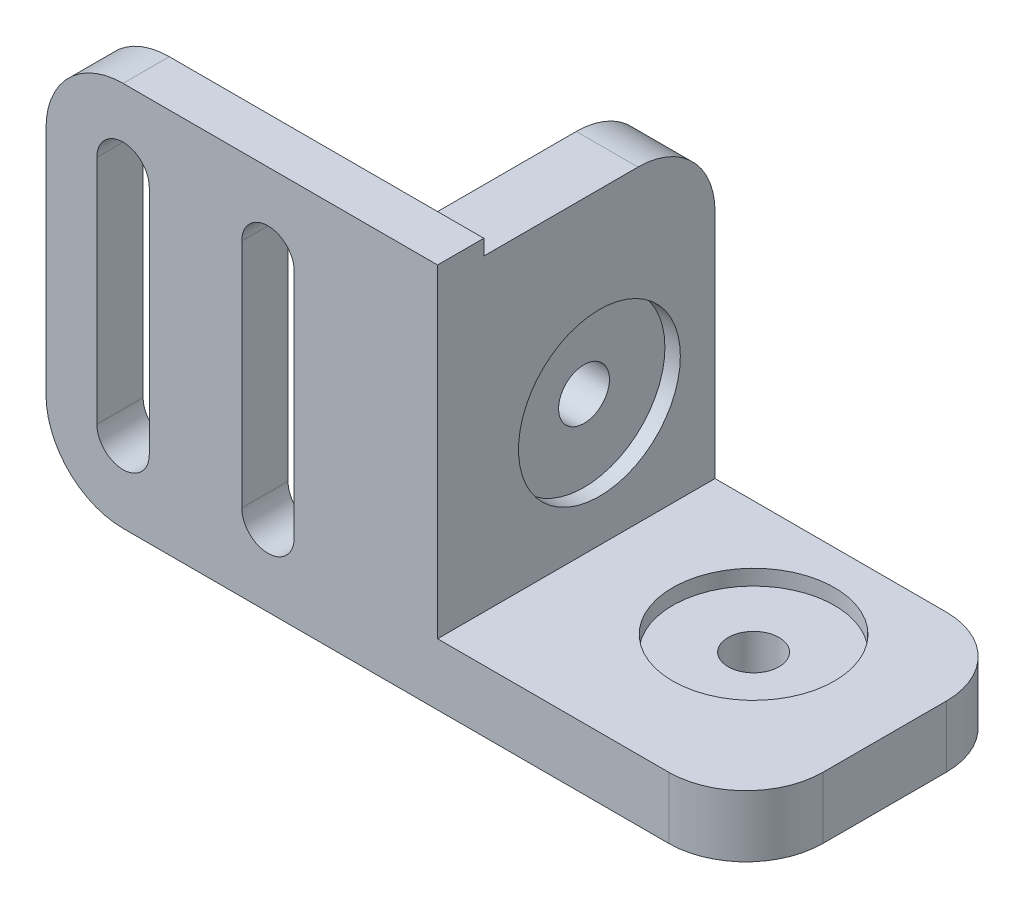
ISO-10303-21;
HEADER;
FILE_DESCRIPTION(('STEP AP214'),'2;1');
FILE_NAME('part.step','',(''),(''),'','','');
FILE_SCHEMA(('AUTOMOTIVE_DESIGN { 1 0 10303 214 1 1 1 1 }'));
ENDSEC;
DATA;
#1=APPLICATION_CONTEXT('core data for automotive mechanical design processes');
#2=APPLICATION_PROTOCOL_DEFINITION('international standard','automotive_design',2000,#1);
#3=PRODUCT_CONTEXT('',#1,'mechanical');
#4=PRODUCT('Part','Part','',(#3));
#5=PRODUCT_RELATED_PRODUCT_CATEGORY('part','',(#4));
#6=PRODUCT_DEFINITION_FORMATION('','',#4);
#7=PRODUCT_DEFINITION_CONTEXT('part definition',#1,'design');
#8=PRODUCT_DEFINITION('design','',#6,#7);
#9=PRODUCT_DEFINITION_SHAPE('','',#8);
#10=(LENGTH_UNIT() NAMED_UNIT(*) SI_UNIT(.MILLI.,.METRE.));
#11=(NAMED_UNIT(*) PLANE_ANGLE_UNIT() SI_UNIT($,.RADIAN.));
#12=(NAMED_UNIT(*) SI_UNIT($,.STERADIAN.) SOLID_ANGLE_UNIT());
#13=UNCERTAINTY_MEASURE_WITH_UNIT(LENGTH_MEASURE(1.E-05),#10,'distance_accuracy_value','');
#14=(GEOMETRIC_REPRESENTATION_CONTEXT(3) GLOBAL_UNCERTAINTY_ASSIGNED_CONTEXT((#13)) GLOBAL_UNIT_ASSIGNED_CONTEXT((#10,
#11,#12)) REPRESENTATION_CONTEXT('',''));
#15=CARTESIAN_POINT('',(0.,0.,0.));
#16=DIRECTION('',(0.,0.,1.));
#17=DIRECTION('',(1.,0.,0.));
#18=AXIS2_PLACEMENT_3D('',#15,#16,#17);
#19=CARTESIAN_POINT('',(20.,8.,7.5));
#20=DIRECTION('',(-1.,0.,0.));
#21=DIRECTION('',(0.,0.,1.));
#22=AXIS2_PLACEMENT_3D('',#19,#20,#21);
#23=CYLINDRICAL_SURFACE('',#22,1.65);
#24=CARTESIAN_POINT('',(-4.,8.,7.5));
#25=DIRECTION('',(1.,0.,0.));
#26=DIRECTION('',(0.,0.,-1.));
#27=AXIS2_PLACEMENT_3D('',#24,#25,#26);
#28=CIRCLE('',#27,1.65);
#29=CARTESIAN_POINT('',(-4.,8.,5.85));
#30=VERTEX_POINT('',#29);
#31=EDGE_CURVE('E293',#30,#30,#28,.T.);
#32=ORIENTED_EDGE('',*,*,#31,.F.);
#33=EDGE_LOOP('',(#32));
#34=FACE_BOUND('',#33,.T.);
#35=CARTESIAN_POINT('',(-1.,8.,7.5));
#36=DIRECTION('',(1.,0.,0.));
#37=DIRECTION('',(0.,0.,-1.));
#38=AXIS2_PLACEMENT_3D('',#35,#36,#37);
#39=CIRCLE('',#38,1.65);
#40=CARTESIAN_POINT('',(-1.,8.,5.85));
#41=VERTEX_POINT('',#40);
#42=EDGE_CURVE('E280',#41,#41,#39,.F.);
#43=ORIENTED_EDGE('',*,*,#42,.F.);
#44=EDGE_LOOP('',(#43));
#45=FACE_BOUND('',#44,.T.);
#46=ADVANCED_FACE('F32',(#34,#45),#23,.F.);
#47=CARTESIAN_POINT('',(10.,-15.,7.5));
#48=DIRECTION('',(0.,1.,0.));
#49=DIRECTION('',(0.,0.,1.));
#50=AXIS2_PLACEMENT_3D('',#47,#48,#49);
#51=CYLINDRICAL_SURFACE('',#50,1.65);
#52=CARTESIAN_POINT('',(10.,-4.,7.5));
#53=DIRECTION('',(0.,1.,0.));
#54=DIRECTION('',(-1.,0.,0.));
#55=AXIS2_PLACEMENT_3D('',#52,#53,#54);
#56=CIRCLE('',#55,1.65);
#57=CARTESIAN_POINT('',(8.35,-4.,7.5));
#58=VERTEX_POINT('',#57);
#59=EDGE_CURVE('E290',#58,#58,#56,.T.);
#60=ORIENTED_EDGE('',*,*,#59,.F.);
#61=EDGE_LOOP('',(#60));
#62=FACE_BOUND('',#61,.T.);
#63=CARTESIAN_POINT('',(10.,-1.,7.5));
#64=DIRECTION('',(0.,1.,0.));
#65=DIRECTION('',(0.,0.,1.));
#66=AXIS2_PLACEMENT_3D('',#63,#64,#65);
#67=CIRCLE('',#66,1.65);
#68=CARTESIAN_POINT('',(10.,-1.,9.15));
#69=VERTEX_POINT('',#68);
#70=EDGE_CURVE('E286',#69,#69,#67,.F.);
#71=ORIENTED_EDGE('',*,*,#70,.F.);
#72=EDGE_LOOP('',(#71));
#73=FACE_BOUND('',#72,.T.);
#74=ADVANCED_FACE('F402',(#62,#73),#51,.F.);
#75=CARTESIAN_POINT('',(0.,20.,15.));
#76=DIRECTION('',(-1.,0.,0.));
#77=DIRECTION('',(0.,0.,1.));
#78=AXIS2_PLACEMENT_3D('',#75,#76,#77);
#79=PLANE('',#78);
#80=CARTESIAN_POINT('',(0.,8.,7.5));
#81=DIRECTION('',(1.,0.,0.));
#82=DIRECTION('',(0.,0.,-1.));
#83=AXIS2_PLACEMENT_3D('',#80,#81,#82);
#84=CIRCLE('',#83,5.25);
#85=CARTESIAN_POINT('',(0.,8.,2.25));
#86=VERTEX_POINT('',#85);
#87=EDGE_CURVE('E276',#86,#86,#84,.T.);
#88=ORIENTED_EDGE('',*,*,#87,.F.);
#89=EDGE_LOOP('',(#88));
#90=FACE_BOUND('',#89,.T.);
#91=DIRECTION('',(0.,1.,0.));
#92=VECTOR('',#91,1.);
#93=CARTESIAN_POINT('',(0.,20.,0.));
#94=LINE('',#93,#92);
#95=CARTESIAN_POINT('',(0.,0.,0.));
#96=VERTEX_POINT('',#95);
#97=CARTESIAN_POINT('',(0.,15.,0.));
#98=VERTEX_POINT('',#97);
#99=EDGE_CURVE('E302',#96,#98,#94,.T.);
#100=ORIENTED_EDGE('',*,*,#99,.T.);
#101=CARTESIAN_POINT('',(0.,15.,5.));
#102=DIRECTION('',(-1.,0.,0.));
#103=DIRECTION('',(0.,0.,1.));
#104=AXIS2_PLACEMENT_3D('',#101,#102,#103);
#105=CIRCLE('',#104,5.);
#106=CARTESIAN_POINT('',(0.,20.,5.));
#107=VERTEX_POINT('',#106);
#108=EDGE_CURVE('E366',#98,#107,#105,.F.);
#109=ORIENTED_EDGE('',*,*,#108,.T.);
#110=DIRECTION('',(0.,0.,-1.));
#111=VECTOR('',#110,1.);
#112=CARTESIAN_POINT('',(0.,20.,15.));
#113=LINE('',#112,#111);
#114=CARTESIAN_POINT('',(0.,20.,15.));
#115=VERTEX_POINT('',#114);
#116=EDGE_CURVE('E325',#115,#107,#113,.T.);
#117=ORIENTED_EDGE('',*,*,#116,.F.);
#118=DIRECTION('',(0.,1.,0.));
#119=VECTOR('',#118,1.);
#120=CARTESIAN_POINT('',(0.,21.,15.));
#121=LINE('',#120,#119);
#122=CARTESIAN_POINT('',(0.,21.,15.));
#123=VERTEX_POINT('',#122);
#124=EDGE_CURVE('E271',#115,#123,#121,.T.);
#125=ORIENTED_EDGE('',*,*,#124,.T.);
#126=DIRECTION('',(0.,0.,-1.));
#127=VECTOR('',#126,1.);
#128=CARTESIAN_POINT('',(0.,21.,18.));
#129=LINE('',#128,#127);
#130=CARTESIAN_POINT('',(0.,21.,18.));
#131=VERTEX_POINT('',#130);
#132=EDGE_CURVE('E267',#131,#123,#129,.T.);
#133=ORIENTED_EDGE('',*,*,#132,.F.);
#134=DIRECTION('',(0.,1.,0.));
#135=VECTOR('',#134,1.);
#136=CARTESIAN_POINT('',(0.,21.,18.));
#137=LINE('',#136,#135);
#138=CARTESIAN_POINT('',(0.,0.,18.));
#139=VERTEX_POINT('',#138);
#140=EDGE_CURVE('E262',#139,#131,#137,.T.);
#141=ORIENTED_EDGE('',*,*,#140,.F.);
#142=DIRECTION('',(0.,0.,-1.));
#143=VECTOR('',#142,1.);
#144=CARTESIAN_POINT('',(0.,0.,15.));
#145=LINE('',#144,#143);
#146=EDGE_CURVE('E301',#139,#96,#145,.T.);
#147=ORIENTED_EDGE('',*,*,#146,.T.);
#148=EDGE_LOOP('',(#100,#109,#117,#125,#133,#141,#147));
#149=FACE_BOUND('',#148,.T.);
#150=ADVANCED_FACE('F408',(#90,#149),#79,.F.);
#151=CARTESIAN_POINT('',(-4.,20.,15.));
#152=DIRECTION('',(0.,-1.,0.));
#153=DIRECTION('',(0.,0.,-1.));
#154=AXIS2_PLACEMENT_3D('',#151,#152,#153);
#155=PLANE('',#154);
#156=ORIENTED_EDGE('',*,*,#116,.T.);
#157=DIRECTION('',(-1.,0.,0.));
#158=VECTOR('',#157,1.);
#159=CARTESIAN_POINT('',(-4.,20.,5.));
#160=LINE('',#159,#158);
#161=CARTESIAN_POINT('',(-4.,20.,5.));
#162=VERTEX_POINT('',#161);
#163=EDGE_CURVE('E361',#107,#162,#160,.T.);
#164=ORIENTED_EDGE('',*,*,#163,.T.);
#165=DIRECTION('',(0.,0.,-1.));
#166=VECTOR('',#165,1.);
#167=CARTESIAN_POINT('',(-4.,20.,15.));
#168=LINE('',#167,#166);
#169=CARTESIAN_POINT('',(-4.,20.,15.));
#170=VERTEX_POINT('',#169);
#171=EDGE_CURVE('E322',#170,#162,#168,.T.);
#172=ORIENTED_EDGE('',*,*,#171,.F.);
#173=DIRECTION('',(-1.,0.,0.));
#174=VECTOR('',#173,1.);
#175=CARTESIAN_POINT('',(-4.,20.,15.));
#176=LINE('',#175,#174);
#177=EDGE_CURVE('E294',#115,#170,#176,.T.);
#178=ORIENTED_EDGE('',*,*,#177,.F.);
#179=EDGE_LOOP('',(#156,#164,#172,#178));
#180=FACE_BOUND('',#179,.T.);
#181=ADVANCED_FACE('F435',(#180),#155,.F.);
#182=CARTESIAN_POINT('',(-4.,-4.,15.));
#183=DIRECTION('',(1.,0.,0.));
#184=DIRECTION('',(0.,0.,-1.));
#185=AXIS2_PLACEMENT_3D('',#182,#183,#184);
#186=PLANE('',#185);
#187=ORIENTED_EDGE('',*,*,#31,.T.);
#188=EDGE_LOOP('',(#187));
#189=FACE_BOUND('',#188,.T.);
#190=ORIENTED_EDGE('',*,*,#171,.T.);
#191=CARTESIAN_POINT('',(-4.,15.,5.));
#192=DIRECTION('',(1.,0.,0.));
#193=DIRECTION('',(0.,0.,-1.));
#194=AXIS2_PLACEMENT_3D('',#191,#192,#193);
#195=CIRCLE('',#194,5.);
#196=CARTESIAN_POINT('',(-4.,15.,0.));
#197=VERTEX_POINT('',#196);
#198=EDGE_CURVE('E364',#162,#197,#195,.F.);
#199=ORIENTED_EDGE('',*,*,#198,.T.);
#200=DIRECTION('',(0.,-1.,0.));
#201=VECTOR('',#200,1.);
#202=CARTESIAN_POINT('',(-4.,-4.,0.));
#203=LINE('',#202,#201);
#204=CARTESIAN_POINT('',(-4.,-4.,0.));
#205=VERTEX_POINT('',#204);
#206=EDGE_CURVE('E305',#197,#205,#203,.T.);
#207=ORIENTED_EDGE('',*,*,#206,.T.);
#208=DIRECTION('',(0.,0.,-1.));
#209=VECTOR('',#208,1.);
#210=CARTESIAN_POINT('',(-4.,-4.,15.));
#211=LINE('',#210,#209);
#212=CARTESIAN_POINT('',(-4.,-4.,15.));
#213=VERTEX_POINT('',#212);
#214=EDGE_CURVE('E319',#213,#205,#211,.T.);
#215=ORIENTED_EDGE('',*,*,#214,.F.);
#216=DIRECTION('',(0.,-1.,0.));
#217=VECTOR('',#216,1.);
#218=CARTESIAN_POINT('',(-4.,-4.,15.));
#219=LINE('',#218,#217);
#220=EDGE_CURVE('E297',#170,#213,#219,.T.);
#221=ORIENTED_EDGE('',*,*,#220,.F.);
#222=EDGE_LOOP('',(#190,#199,#207,#215,#221));
#223=FACE_BOUND('',#222,.T.);
#224=ADVANCED_FACE('F431',(#189,#223),#186,.F.);
#225=CARTESIAN_POINT('',(20.,-4.,15.));
#226=DIRECTION('',(0.,1.,0.));
#227=DIRECTION('',(-1.,0.,0.));
#228=AXIS2_PLACEMENT_3D('',#225,#226,#227);
#229=PLANE('',#228);
#230=ORIENTED_EDGE('',*,*,#59,.T.);
#231=EDGE_LOOP('',(#230));
#232=FACE_BOUND('',#231,.T.);
#233=DIRECTION('',(0.,0.,-1.));
#234=VECTOR('',#233,1.);
#235=CARTESIAN_POINT('',(20.,-4.,15.));
#236=LINE('',#235,#234);
#237=CARTESIAN_POINT('',(20.,-4.,13.));
#238=VERTEX_POINT('',#237);
#239=CARTESIAN_POINT('',(20.,-4.,5.));
#240=VERTEX_POINT('',#239);
#241=EDGE_CURVE('E316',#238,#240,#236,.T.);
#242=ORIENTED_EDGE('',*,*,#241,.F.);
#243=CARTESIAN_POINT('',(15.,-4.,13.));
#244=DIRECTION('',(0.,1.,0.));
#245=DIRECTION('',(-1.,0.,0.));
#246=AXIS2_PLACEMENT_3D('',#243,#244,#245);
#247=CIRCLE('',#246,5.);
#248=CARTESIAN_POINT('',(15.,-4.,18.));
#249=VERTEX_POINT('',#248);
#250=EDGE_CURVE('E355',#238,#249,#247,.F.);
#251=ORIENTED_EDGE('',*,*,#250,.T.);
#252=DIRECTION('',(1.,0.,0.));
#253=VECTOR('',#252,1.);
#254=CARTESIAN_POINT('',(20.,-4.,18.));
#255=LINE('',#254,#253);
#256=CARTESIAN_POINT('',(-20.4,-4.00000000000001,18.));
#257=VERTEX_POINT('',#256);
#258=EDGE_CURVE('E256',#257,#249,#255,.T.);
#259=ORIENTED_EDGE('',*,*,#258,.F.);
#260=DIRECTION('',(0.,0.,-1.));
#261=VECTOR('',#260,1.);
#262=CARTESIAN_POINT('',(-20.4,-4.,15.));
#263=LINE('',#262,#261);
#264=CARTESIAN_POINT('',(-20.4,-4.00000000000001,15.));
#265=VERTEX_POINT('',#264);
#266=EDGE_CURVE('E350',#257,#265,#263,.T.);
#267=ORIENTED_EDGE('',*,*,#266,.T.);
#268=DIRECTION('',(1.,0.,0.));
#269=VECTOR('',#268,1.);
#270=CARTESIAN_POINT('',(20.,-4.,15.));
#271=LINE('',#270,#269);
#272=EDGE_CURVE('E269',#265,#213,#271,.T.);
#273=ORIENTED_EDGE('',*,*,#272,.T.);
#274=ORIENTED_EDGE('',*,*,#214,.T.);
#275=DIRECTION('',(1.,0.,0.));
#276=VECTOR('',#275,1.);
#277=CARTESIAN_POINT('',(20.,-4.,0.));
#278=LINE('',#277,#276);
#279=CARTESIAN_POINT('',(15.,-4.,0.));
#280=VERTEX_POINT('',#279);
#281=EDGE_CURVE('E307',#205,#280,#278,.T.);
#282=ORIENTED_EDGE('',*,*,#281,.T.);
#283=CARTESIAN_POINT('',(15.,-4.,5.));
#284=DIRECTION('',(0.,1.,0.));
#285=DIRECTION('',(-1.,0.,0.));
#286=AXIS2_PLACEMENT_3D('',#283,#284,#285);
#287=CIRCLE('',#286,5.);
#288=EDGE_CURVE('E353',#280,#240,#287,.F.);
#289=ORIENTED_EDGE('',*,*,#288,.T.);
#290=EDGE_LOOP('',(#242,#251,#259,#267,#273,#274,#282,#289));
#291=FACE_BOUND('',#290,.T.);
#292=ADVANCED_FACE('F427',(#232,#291),#229,.F.);
#293=CARTESIAN_POINT('',(20.,0.,15.));
#294=DIRECTION('',(-1.,0.,0.));
#295=DIRECTION('',(0.,0.,1.));
#296=AXIS2_PLACEMENT_3D('',#293,#294,#295);
#297=PLANE('',#296);
#298=DIRECTION('',(0.,0.,-1.));
#299=VECTOR('',#298,1.);
#300=CARTESIAN_POINT('',(20.,0.,15.));
#301=LINE('',#300,#299);
#302=CARTESIAN_POINT('',(20.,0.,13.));
#303=VERTEX_POINT('',#302);
#304=CARTESIAN_POINT('',(20.,0.,5.));
#305=VERTEX_POINT('',#304);
#306=EDGE_CURVE('E313',#303,#305,#301,.T.);
#307=ORIENTED_EDGE('',*,*,#306,.F.);
#308=DIRECTION('',(0.,1.,0.));
#309=VECTOR('',#308,1.);
#310=CARTESIAN_POINT('',(20.,0.,13.));
#311=LINE('',#310,#309);
#312=EDGE_CURVE('E348',#303,#238,#311,.F.);
#313=ORIENTED_EDGE('',*,*,#312,.T.);
#314=ORIENTED_EDGE('',*,*,#241,.T.);
#315=DIRECTION('',(0.,1.,0.));
#316=VECTOR('',#315,1.);
#317=CARTESIAN_POINT('',(20.,0.,5.));
#318=LINE('',#317,#316);
#319=EDGE_CURVE('E345',#240,#305,#318,.T.);
#320=ORIENTED_EDGE('',*,*,#319,.T.);
#321=EDGE_LOOP('',(#307,#313,#314,#320));
#322=FACE_BOUND('',#321,.T.);
#323=ADVANCED_FACE('F423',(#322),#297,.F.);
#324=CARTESIAN_POINT('',(0.,0.,15.));
#325=DIRECTION('',(0.,-1.,0.));
#326=DIRECTION('',(0.,0.,-1.));
#327=AXIS2_PLACEMENT_3D('',#324,#325,#326);
#328=PLANE('',#327);
#329=CARTESIAN_POINT('',(10.,0.,7.5));
#330=DIRECTION('',(0.,1.,0.));
#331=DIRECTION('',(0.,0.,1.));
#332=AXIS2_PLACEMENT_3D('',#329,#330,#331);
#333=CIRCLE('',#332,5.25);
#334=CARTESIAN_POINT('',(10.,0.,12.75));
#335=VERTEX_POINT('',#334);
#336=EDGE_CURVE('E287',#335,#335,#333,.T.);
#337=ORIENTED_EDGE('',*,*,#336,.F.);
#338=EDGE_LOOP('',(#337));
#339=FACE_BOUND('',#338,.T.);
#340=DIRECTION('',(-1.,0.,0.));
#341=VECTOR('',#340,1.);
#342=CARTESIAN_POINT('',(0.,0.,18.));
#343=LINE('',#342,#341);
#344=CARTESIAN_POINT('',(15.,0.,18.));
#345=VERTEX_POINT('',#344);
#346=EDGE_CURVE('E260',#345,#139,#343,.T.);
#347=ORIENTED_EDGE('',*,*,#346,.F.);
#348=CARTESIAN_POINT('',(15.,0.,13.));
#349=DIRECTION('',(0.,-1.,0.));
#350=DIRECTION('',(0.,0.,-1.));
#351=AXIS2_PLACEMENT_3D('',#348,#349,#350);
#352=CIRCLE('',#351,5.);
#353=EDGE_CURVE('E343',#345,#303,#352,.F.);
#354=ORIENTED_EDGE('',*,*,#353,.T.);
#355=ORIENTED_EDGE('',*,*,#306,.T.);
#356=CARTESIAN_POINT('',(15.,0.,5.));
#357=DIRECTION('',(0.,-1.,0.));
#358=DIRECTION('',(0.,0.,-1.));
#359=AXIS2_PLACEMENT_3D('',#356,#357,#358);
#360=CIRCLE('',#359,5.);
#361=CARTESIAN_POINT('',(15.,0.,0.));
#362=VERTEX_POINT('',#361);
#363=EDGE_CURVE('E341',#305,#362,#360,.F.);
#364=ORIENTED_EDGE('',*,*,#363,.T.);
#365=DIRECTION('',(-1.,0.,0.));
#366=VECTOR('',#365,1.);
#367=CARTESIAN_POINT('',(0.,0.,0.));
#368=LINE('',#367,#366);
#369=EDGE_CURVE('E298',#362,#96,#368,.T.);
#370=ORIENTED_EDGE('',*,*,#369,.T.);
#371=ORIENTED_EDGE('',*,*,#146,.F.);
#372=EDGE_LOOP('',(#347,#354,#355,#364,#370,#371));
#373=FACE_BOUND('',#372,.T.);
#374=ADVANCED_FACE('F419',(#339,#373),#328,.F.);
#375=CARTESIAN_POINT('',(0.,0.,0.));
#376=DIRECTION('',(0.,0.,1.));
#377=DIRECTION('',(1.,0.,0.));
#378=AXIS2_PLACEMENT_3D('',#375,#376,#377);
#379=PLANE('',#378);
#380=ORIENTED_EDGE('',*,*,#369,.F.);
#381=DIRECTION('',(0.,1.,0.));
#382=VECTOR('',#381,1.);
#383=CARTESIAN_POINT('',(15.,0.,0.));
#384=LINE('',#383,#382);
#385=EDGE_CURVE('E359',#362,#280,#384,.F.);
#386=ORIENTED_EDGE('',*,*,#385,.T.);
#387=ORIENTED_EDGE('',*,*,#281,.F.);
#388=ORIENTED_EDGE('',*,*,#206,.F.);
#389=DIRECTION('',(-1.,0.,0.));
#390=VECTOR('',#389,1.);
#391=CARTESIAN_POINT('',(0.,15.,0.));
#392=LINE('',#391,#390);
#393=EDGE_CURVE('E357',#197,#98,#392,.F.);
#394=ORIENTED_EDGE('',*,*,#393,.T.);
#395=ORIENTED_EDGE('',*,*,#99,.F.);
#396=EDGE_LOOP('',(#380,#386,#387,#388,#394,#395));
#397=FACE_BOUND('',#396,.T.);
#398=ADVANCED_FACE('F415',(#397),#379,.F.);
#399=CARTESIAN_POINT('',(10.,-1.,7.5));
#400=DIRECTION('',(0.,1.,0.));
#401=DIRECTION('',(0.,0.,1.));
#402=AXIS2_PLACEMENT_3D('',#399,#400,#401);
#403=PLANE('',#402);
#404=CARTESIAN_POINT('',(10.,-1.,7.5));
#405=DIRECTION('',(0.,1.,0.));
#406=DIRECTION('',(0.,0.,1.));
#407=AXIS2_PLACEMENT_3D('',#404,#405,#406);
#408=CIRCLE('',#407,5.25);
#409=CARTESIAN_POINT('',(10.,-1.,12.75));
#410=VERTEX_POINT('',#409);
#411=EDGE_CURVE('E283',#410,#410,#408,.T.);
#412=ORIENTED_EDGE('',*,*,#411,.T.);
#413=EDGE_LOOP('',(#412));
#414=FACE_BOUND('',#413,.T.);
#415=ORIENTED_EDGE('',*,*,#70,.T.);
#416=EDGE_LOOP('',(#415));
#417=FACE_BOUND('',#416,.T.);
#418=ADVANCED_FACE('F418',(#414,#417),#403,.T.);
#419=CARTESIAN_POINT('',(10.,-1.,7.5));
#420=DIRECTION('',(0.,1.,0.));
#421=DIRECTION('',(0.,0.,1.));
#422=AXIS2_PLACEMENT_3D('',#419,#420,#421);
#423=CYLINDRICAL_SURFACE('',#422,5.25);
#424=ORIENTED_EDGE('',*,*,#411,.F.);
#425=EDGE_LOOP('',(#424));
#426=FACE_BOUND('',#425,.T.);
#427=ORIENTED_EDGE('',*,*,#336,.T.);
#428=EDGE_LOOP('',(#427));
#429=FACE_BOUND('',#428,.T.);
#430=ADVANCED_FACE('F511',(#426,#429),#423,.F.);
#431=CARTESIAN_POINT('',(-1.,8.,7.5));
#432=DIRECTION('',(1.,0.,0.));
#433=DIRECTION('',(0.,0.,-1.));
#434=AXIS2_PLACEMENT_3D('',#431,#432,#433);
#435=PLANE('',#434);
#436=CARTESIAN_POINT('',(-1.,8.,7.5));
#437=DIRECTION('',(1.,0.,0.));
#438=DIRECTION('',(0.,0.,-1.));
#439=AXIS2_PLACEMENT_3D('',#436,#437,#438);
#440=CIRCLE('',#439,5.25);
#441=CARTESIAN_POINT('',(-1.,8.,2.25));
#442=VERTEX_POINT('',#441);
#443=EDGE_CURVE('E277',#442,#442,#440,.T.);
#444=ORIENTED_EDGE('',*,*,#443,.T.);
#445=EDGE_LOOP('',(#444));
#446=FACE_BOUND('',#445,.T.);
#447=ORIENTED_EDGE('',*,*,#42,.T.);
#448=EDGE_LOOP('',(#447));
#449=FACE_BOUND('',#448,.T.);
#450=ADVANCED_FACE('F507',(#446,#449),#435,.T.);
#451=CARTESIAN_POINT('',(-1.,8.,7.5));
#452=DIRECTION('',(1.,0.,0.));
#453=DIRECTION('',(0.,0.,-1.));
#454=AXIS2_PLACEMENT_3D('',#451,#452,#453);
#455=CYLINDRICAL_SURFACE('',#454,5.25);
#456=ORIENTED_EDGE('',*,*,#443,.F.);
#457=EDGE_LOOP('',(#456));
#458=FACE_BOUND('',#457,.T.);
#459=ORIENTED_EDGE('',*,*,#87,.T.);
#460=EDGE_LOOP('',(#459));
#461=FACE_BOUND('',#460,.T.);
#462=ADVANCED_FACE('F510',(#458,#461),#455,.F.);
#463=CARTESIAN_POINT('',(0.,0.,18.));
#464=DIRECTION('',(0.,0.,-1.));
#465=DIRECTION('',(-1.,0.,0.));
#466=AXIS2_PLACEMENT_3D('',#463,#464,#465);
#467=PLANE('',#466);
#468=CARTESIAN_POINT('',(-20.4,16.,18.));
#469=DIRECTION('',(0.,0.,1.));
#470=DIRECTION('',(-1.,0.,0.));
#471=AXIS2_PLACEMENT_3D('',#468,#469,#470);
#472=CIRCLE('',#471,1.7);
#473=CARTESIAN_POINT('',(-18.7,16.,18.));
#474=VERTEX_POINT('',#473);
#475=CARTESIAN_POINT('',(-22.1,16.,18.));
#476=VERTEX_POINT('',#475);
#477=EDGE_CURVE('E222',#474,#476,#472,.T.);
#478=ORIENTED_EDGE('',*,*,#477,.F.);
#479=DIRECTION('',(0.,1.,0.));
#480=VECTOR('',#479,1.);
#481=CARTESIAN_POINT('',(-18.7,16.,18.));
#482=LINE('',#481,#480);
#483=CARTESIAN_POINT('',(-18.7,0.999999999999996,18.));
#484=VERTEX_POINT('',#483);
#485=EDGE_CURVE('E230',#484,#474,#482,.T.);
#486=ORIENTED_EDGE('',*,*,#485,.F.);
#487=CARTESIAN_POINT('',(-20.4,0.999999999999996,18.));
#488=DIRECTION('',(0.,0.,1.));
#489=DIRECTION('',(1.,0.,0.));
#490=AXIS2_PLACEMENT_3D('',#487,#488,#489);
#491=CIRCLE('',#490,1.7);
#492=CARTESIAN_POINT('',(-22.1,0.999999999999995,18.));
#493=VERTEX_POINT('',#492);
#494=EDGE_CURVE('E227',#493,#484,#491,.T.);
#495=ORIENTED_EDGE('',*,*,#494,.F.);
#496=DIRECTION('',(0.,-1.,0.));
#497=VECTOR('',#496,1.);
#498=CARTESIAN_POINT('',(-22.1,16.,18.));
#499=LINE('',#498,#497);
#500=EDGE_CURVE('E224',#476,#493,#499,.T.);
#501=ORIENTED_EDGE('',*,*,#500,.F.);
#502=EDGE_LOOP('',(#478,#486,#495,#501));
#503=FACE_BOUND('',#502,.T.);
#504=ORIENTED_EDGE('',*,*,#258,.T.);
#505=DIRECTION('',(0.,1.,0.));
#506=VECTOR('',#505,1.);
#507=CARTESIAN_POINT('',(15.,0.,18.));
#508=LINE('',#507,#506);
#509=EDGE_CURVE('E338',#249,#345,#508,.T.);
#510=ORIENTED_EDGE('',*,*,#509,.T.);
#511=ORIENTED_EDGE('',*,*,#346,.T.);
#512=ORIENTED_EDGE('',*,*,#140,.T.);
#513=DIRECTION('',(-1.,0.,0.));
#514=VECTOR('',#513,1.);
#515=CARTESIAN_POINT('',(-25.4,21.,18.));
#516=LINE('',#515,#514);
#517=CARTESIAN_POINT('',(-20.4,21.,18.));
#518=VERTEX_POINT('',#517);
#519=EDGE_CURVE('E264',#131,#518,#516,.T.);
#520=ORIENTED_EDGE('',*,*,#519,.T.);
#521=CARTESIAN_POINT('',(-20.4,16.,18.));
#522=DIRECTION('',(0.,0.,-1.));
#523=DIRECTION('',(-1.,0.,0.));
#524=AXIS2_PLACEMENT_3D('',#521,#522,#523);
#525=CIRCLE('',#524,5.);
#526=CARTESIAN_POINT('',(-25.4,16.,18.));
#527=VERTEX_POINT('',#526);
#528=EDGE_CURVE('E336',#518,#527,#525,.F.);
#529=ORIENTED_EDGE('',*,*,#528,.T.);
#530=DIRECTION('',(0.,-1.,0.));
#531=VECTOR('',#530,1.);
#532=CARTESIAN_POINT('',(-25.4,-4.00000000000001,18.));
#533=LINE('',#532,#531);
#534=CARTESIAN_POINT('',(-25.4,0.999999999999996,18.));
#535=VERTEX_POINT('',#534);
#536=EDGE_CURVE('E253',#527,#535,#533,.T.);
#537=ORIENTED_EDGE('',*,*,#536,.T.);
#538=CARTESIAN_POINT('',(-20.4,0.999999999999996,18.));
#539=DIRECTION('',(0.,0.,-1.));
#540=DIRECTION('',(-1.,0.,0.));
#541=AXIS2_PLACEMENT_3D('',#538,#539,#540);
#542=CIRCLE('',#541,5.);
#543=EDGE_CURVE('E328',#535,#257,#542,.F.);
#544=ORIENTED_EDGE('',*,*,#543,.T.);
#545=EDGE_LOOP('',(#504,#510,#511,#512,#520,#529,#537,#544));
#546=FACE_BOUND('',#545,.T.);
#547=CARTESIAN_POINT('',(-11.,0.999999999999996,18.));
#548=DIRECTION('',(0.,0.,1.));
#549=DIRECTION('',(-1.,0.,0.));
#550=AXIS2_PLACEMENT_3D('',#547,#548,#549);
#551=CIRCLE('',#550,1.7);
#552=CARTESIAN_POINT('',(-12.7,0.999999999999996,18.));
#553=VERTEX_POINT('',#552);
#554=CARTESIAN_POINT('',(-9.3,0.999999999999996,18.));
#555=VERTEX_POINT('',#554);
#556=EDGE_CURVE('E180',#553,#555,#551,.T.);
#557=ORIENTED_EDGE('',*,*,#556,.F.);
#558=DIRECTION('',(0.,-1.,0.));
#559=VECTOR('',#558,1.);
#560=CARTESIAN_POINT('',(-12.7,0.999999999999996,18.));
#561=LINE('',#560,#559);
#562=CARTESIAN_POINT('',(-12.7,16.,18.));
#563=VERTEX_POINT('',#562);
#564=EDGE_CURVE('E206',#563,#553,#561,.T.);
#565=ORIENTED_EDGE('',*,*,#564,.F.);
#566=CARTESIAN_POINT('',(-11.,16.,18.));
#567=DIRECTION('',(0.,0.,1.));
#568=DIRECTION('',(1.,0.,0.));
#569=AXIS2_PLACEMENT_3D('',#566,#567,#568);
#570=CIRCLE('',#569,1.7);
#571=CARTESIAN_POINT('',(-9.3,16.,18.));
#572=VERTEX_POINT('',#571);
#573=EDGE_CURVE('E204',#572,#563,#570,.T.);
#574=ORIENTED_EDGE('',*,*,#573,.F.);
#575=DIRECTION('',(0.,1.,0.));
#576=VECTOR('',#575,1.);
#577=CARTESIAN_POINT('',(-9.3,0.999999999999996,18.));
#578=LINE('',#577,#576);
#579=EDGE_CURVE('E190',#555,#572,#578,.T.);
#580=ORIENTED_EDGE('',*,*,#579,.F.);
#581=EDGE_LOOP('',(#557,#565,#574,#580));
#582=FACE_BOUND('',#581,.T.);
#583=ADVANCED_FACE('F202',(#503,#546,#582),#467,.F.);
#584=CARTESIAN_POINT('',(0.,0.,15.));
#585=DIRECTION('',(0.,0.,-1.));
#586=DIRECTION('',(-1.,0.,0.));
#587=AXIS2_PLACEMENT_3D('',#584,#585,#586);
#588=PLANE('',#587);
#589=DIRECTION('',(0.,-1.,0.));
#590=VECTOR('',#589,1.);
#591=CARTESIAN_POINT('',(-25.4,-4.00000000000001,15.));
#592=LINE('',#591,#590);
#593=CARTESIAN_POINT('',(-25.4,16.,15.));
#594=VERTEX_POINT('',#593);
#595=CARTESIAN_POINT('',(-25.4,0.999999999999996,15.));
#596=VERTEX_POINT('',#595);
#597=EDGE_CURVE('E252',#594,#596,#592,.T.);
#598=ORIENTED_EDGE('',*,*,#597,.F.);
#599=CARTESIAN_POINT('',(-20.4,16.,15.));
#600=DIRECTION('',(0.,0.,-1.));
#601=DIRECTION('',(-1.,0.,0.));
#602=AXIS2_PLACEMENT_3D('',#599,#600,#601);
#603=CIRCLE('',#602,5.);
#604=CARTESIAN_POINT('',(-20.4,21.,15.));
#605=VERTEX_POINT('',#604);
#606=EDGE_CURVE('E40',#594,#605,#603,.T.);
#607=ORIENTED_EDGE('',*,*,#606,.T.);
#608=DIRECTION('',(-1.,0.,0.));
#609=VECTOR('',#608,1.);
#610=CARTESIAN_POINT('',(-25.4,21.,15.));
#611=LINE('',#610,#609);
#612=EDGE_CURVE('E257',#123,#605,#611,.T.);
#613=ORIENTED_EDGE('',*,*,#612,.F.);
#614=ORIENTED_EDGE('',*,*,#124,.F.);
#615=ORIENTED_EDGE('',*,*,#177,.T.);
#616=ORIENTED_EDGE('',*,*,#220,.T.);
#617=ORIENTED_EDGE('',*,*,#272,.F.);
#618=CARTESIAN_POINT('',(-20.4,0.999999999999996,15.));
#619=DIRECTION('',(0.,0.,-1.));
#620=DIRECTION('',(-1.,0.,0.));
#621=AXIS2_PLACEMENT_3D('',#618,#619,#620);
#622=CIRCLE('',#621,5.);
#623=EDGE_CURVE('E52',#265,#596,#622,.T.);
#624=ORIENTED_EDGE('',*,*,#623,.T.);
#625=EDGE_LOOP('',(#598,#607,#613,#614,#615,#616,#617,#624));
#626=FACE_BOUND('',#625,.T.);
#627=DIRECTION('',(0.,1.,0.));
#628=VECTOR('',#627,1.);
#629=CARTESIAN_POINT('',(-18.7,16.,15.));
#630=LINE('',#629,#628);
#631=CARTESIAN_POINT('',(-18.7,0.999999999999996,15.));
#632=VERTEX_POINT('',#631);
#633=CARTESIAN_POINT('',(-18.7,16.,15.));
#634=VERTEX_POINT('',#633);
#635=EDGE_CURVE('E225',#632,#634,#630,.T.);
#636=ORIENTED_EDGE('',*,*,#635,.T.);
#637=CARTESIAN_POINT('',(-20.4,16.,15.));
#638=DIRECTION('',(0.,0.,1.));
#639=DIRECTION('',(-1.,0.,0.));
#640=AXIS2_PLACEMENT_3D('',#637,#638,#639);
#641=CIRCLE('',#640,1.7);
#642=CARTESIAN_POINT('',(-22.1,16.,15.));
#643=VERTEX_POINT('',#642);
#644=EDGE_CURVE('E198',#634,#643,#641,.T.);
#645=ORIENTED_EDGE('',*,*,#644,.T.);
#646=DIRECTION('',(0.,-1.,0.));
#647=VECTOR('',#646,1.);
#648=CARTESIAN_POINT('',(-22.1,16.,15.));
#649=LINE('',#648,#647);
#650=CARTESIAN_POINT('',(-22.1,0.999999999999995,15.));
#651=VERTEX_POINT('',#650);
#652=EDGE_CURVE('E235',#643,#651,#649,.T.);
#653=ORIENTED_EDGE('',*,*,#652,.T.);
#654=CARTESIAN_POINT('',(-20.4,0.999999999999996,15.));
#655=DIRECTION('',(0.,0.,1.));
#656=DIRECTION('',(1.,0.,0.));
#657=AXIS2_PLACEMENT_3D('',#654,#655,#656);
#658=CIRCLE('',#657,1.7);
#659=EDGE_CURVE('E238',#651,#632,#658,.T.);
#660=ORIENTED_EDGE('',*,*,#659,.T.);
#661=EDGE_LOOP('',(#636,#645,#653,#660));
#662=FACE_BOUND('',#661,.T.);
#663=DIRECTION('',(0.,-1.,0.));
#664=VECTOR('',#663,1.);
#665=CARTESIAN_POINT('',(-12.7,0.999999999999996,15.));
#666=LINE('',#665,#664);
#667=CARTESIAN_POINT('',(-12.7,16.,15.));
#668=VERTEX_POINT('',#667);
#669=CARTESIAN_POINT('',(-12.7,0.999999999999996,15.));
#670=VERTEX_POINT('',#669);
#671=EDGE_CURVE('E191',#668,#670,#666,.T.);
#672=ORIENTED_EDGE('',*,*,#671,.T.);
#673=CARTESIAN_POINT('',(-11.,0.999999999999996,15.));
#674=DIRECTION('',(0.,0.,1.));
#675=DIRECTION('',(-1.,0.,0.));
#676=AXIS2_PLACEMENT_3D('',#673,#674,#675);
#677=CIRCLE('',#676,1.7);
#678=CARTESIAN_POINT('',(-9.3,0.999999999999996,15.));
#679=VERTEX_POINT('',#678);
#680=EDGE_CURVE('E210',#670,#679,#677,.T.);
#681=ORIENTED_EDGE('',*,*,#680,.T.);
#682=DIRECTION('',(0.,1.,0.));
#683=VECTOR('',#682,1.);
#684=CARTESIAN_POINT('',(-9.3,0.999999999999996,15.));
#685=LINE('',#684,#683);
#686=CARTESIAN_POINT('',(-9.3,16.,15.));
#687=VERTEX_POINT('',#686);
#688=EDGE_CURVE('E197',#679,#687,#685,.T.);
#689=ORIENTED_EDGE('',*,*,#688,.T.);
#690=CARTESIAN_POINT('',(-11.,16.,15.));
#691=DIRECTION('',(0.,0.,1.));
#692=DIRECTION('',(1.,0.,0.));
#693=AXIS2_PLACEMENT_3D('',#690,#691,#692);
#694=CIRCLE('',#693,1.7);
#695=EDGE_CURVE('E213',#687,#668,#694,.T.);
#696=ORIENTED_EDGE('',*,*,#695,.T.);
#697=EDGE_LOOP('',(#672,#681,#689,#696));
#698=FACE_BOUND('',#697,.T.);
#699=ADVANCED_FACE('F380',(#626,#662,#698),#588,.T.);
#700=CARTESIAN_POINT('',(-25.4,-4.00000000000001,18.));
#701=DIRECTION('',(1.,0.,0.));
#702=DIRECTION('',(0.,0.,-1.));
#703=AXIS2_PLACEMENT_3D('',#700,#701,#702);
#704=PLANE('',#703);
#705=ORIENTED_EDGE('',*,*,#536,.F.);
#706=DIRECTION('',(0.,0.,-1.));
#707=VECTOR('',#706,1.);
#708=CARTESIAN_POINT('',(-25.4,16.,18.));
#709=LINE('',#708,#707);
#710=EDGE_CURVE('E370',#527,#594,#709,.T.);
#711=ORIENTED_EDGE('',*,*,#710,.T.);
#712=ORIENTED_EDGE('',*,*,#597,.T.);
#713=DIRECTION('',(0.,0.,-1.));
#714=VECTOR('',#713,1.);
#715=CARTESIAN_POINT('',(-25.4,0.999999999999996,18.));
#716=LINE('',#715,#714);
#717=EDGE_CURVE('E368',#596,#535,#716,.F.);
#718=ORIENTED_EDGE('',*,*,#717,.T.);
#719=EDGE_LOOP('',(#705,#711,#712,#718));
#720=FACE_BOUND('',#719,.T.);
#721=ADVANCED_FACE('F376',(#720),#704,.F.);
#722=CARTESIAN_POINT('',(-25.4,21.,18.));
#723=DIRECTION('',(0.,-1.,0.));
#724=DIRECTION('',(1.,0.,0.));
#725=AXIS2_PLACEMENT_3D('',#722,#723,#724);
#726=PLANE('',#725);
#727=ORIENTED_EDGE('',*,*,#612,.T.);
#728=DIRECTION('',(0.,0.,-1.));
#729=VECTOR('',#728,1.);
#730=CARTESIAN_POINT('',(-20.4,21.,18.));
#731=LINE('',#730,#729);
#732=EDGE_CURVE('E11',#605,#518,#731,.F.);
#733=ORIENTED_EDGE('',*,*,#732,.T.);
#734=ORIENTED_EDGE('',*,*,#519,.F.);
#735=ORIENTED_EDGE('',*,*,#132,.T.);
#736=EDGE_LOOP('',(#727,#733,#734,#735));
#737=FACE_BOUND('',#736,.T.);
#738=ADVANCED_FACE('F466',(#737),#726,.F.);
#739=CARTESIAN_POINT('',(-20.4,16.,18.));
#740=DIRECTION('',(0.,0.,-1.));
#741=DIRECTION('',(-1.,0.,0.));
#742=AXIS2_PLACEMENT_3D('',#739,#740,#741);
#743=CYLINDRICAL_SURFACE('',#742,1.7);
#744=ORIENTED_EDGE('',*,*,#644,.F.);
#745=DIRECTION('',(0.,0.,-1.));
#746=VECTOR('',#745,1.);
#747=CARTESIAN_POINT('',(-18.7,16.,18.));
#748=LINE('',#747,#746);
#749=EDGE_CURVE('E232',#474,#634,#748,.T.);
#750=ORIENTED_EDGE('',*,*,#749,.F.);
#751=ORIENTED_EDGE('',*,*,#477,.T.);
#752=DIRECTION('',(0.,0.,-1.));
#753=VECTOR('',#752,1.);
#754=CARTESIAN_POINT('',(-22.1,16.,18.));
#755=LINE('',#754,#753);
#756=EDGE_CURVE('E249',#476,#643,#755,.T.);
#757=ORIENTED_EDGE('',*,*,#756,.T.);
#758=EDGE_LOOP('',(#744,#750,#751,#757));
#759=FACE_BOUND('',#758,.T.);
#760=ADVANCED_FACE('F495',(#759),#743,.F.);
#761=CARTESIAN_POINT('',(-22.1,16.,18.));
#762=DIRECTION('',(1.,0.,0.));
#763=DIRECTION('',(0.,1.,0.));
#764=AXIS2_PLACEMENT_3D('',#761,#762,#763);
#765=PLANE('',#764);
#766=ORIENTED_EDGE('',*,*,#652,.F.);
#767=ORIENTED_EDGE('',*,*,#756,.F.);
#768=ORIENTED_EDGE('',*,*,#500,.T.);
#769=DIRECTION('',(0.,0.,-1.));
#770=VECTOR('',#769,1.);
#771=CARTESIAN_POINT('',(-22.1,0.999999999999995,18.));
#772=LINE('',#771,#770);
#773=EDGE_CURVE('E247',#493,#651,#772,.T.);
#774=ORIENTED_EDGE('',*,*,#773,.T.);
#775=EDGE_LOOP('',(#766,#767,#768,#774));
#776=FACE_BOUND('',#775,.T.);
#777=ADVANCED_FACE('F501',(#776),#765,.T.);
#778=CARTESIAN_POINT('',(-20.4,0.999999999999996,18.));
#779=DIRECTION('',(0.,0.,-1.));
#780=DIRECTION('',(-1.,0.,0.));
#781=AXIS2_PLACEMENT_3D('',#778,#779,#780);
#782=CYLINDRICAL_SURFACE('',#781,1.7);
#783=ORIENTED_EDGE('',*,*,#659,.F.);
#784=ORIENTED_EDGE('',*,*,#773,.F.);
#785=ORIENTED_EDGE('',*,*,#494,.T.);
#786=DIRECTION('',(0.,0.,-1.));
#787=VECTOR('',#786,1.);
#788=CARTESIAN_POINT('',(-18.7,0.999999999999996,18.));
#789=LINE('',#788,#787);
#790=EDGE_CURVE('E245',#484,#632,#789,.T.);
#791=ORIENTED_EDGE('',*,*,#790,.T.);
#792=EDGE_LOOP('',(#783,#784,#785,#791));
#793=FACE_BOUND('',#792,.T.);
#794=ADVANCED_FACE('F698',(#793),#782,.F.);
#795=CARTESIAN_POINT('',(-18.7,16.,18.));
#796=DIRECTION('',(-1.,0.,0.));
#797=DIRECTION('',(0.,-1.,0.));
#798=AXIS2_PLACEMENT_3D('',#795,#796,#797);
#799=PLANE('',#798);
#800=ORIENTED_EDGE('',*,*,#635,.F.);
#801=ORIENTED_EDGE('',*,*,#790,.F.);
#802=ORIENTED_EDGE('',*,*,#485,.T.);
#803=ORIENTED_EDGE('',*,*,#749,.T.);
#804=EDGE_LOOP('',(#800,#801,#802,#803));
#805=FACE_BOUND('',#804,.T.);
#806=ADVANCED_FACE('F689',(#805),#799,.T.);
#807=CARTESIAN_POINT('',(-11.,0.999999999999996,18.));
#808=DIRECTION('',(0.,0.,-1.));
#809=DIRECTION('',(-1.,0.,0.));
#810=AXIS2_PLACEMENT_3D('',#807,#808,#809);
#811=CYLINDRICAL_SURFACE('',#810,1.7);
#812=ORIENTED_EDGE('',*,*,#680,.F.);
#813=DIRECTION('',(0.,0.,-1.));
#814=VECTOR('',#813,1.);
#815=CARTESIAN_POINT('',(-12.7,0.999999999999996,18.));
#816=LINE('',#815,#814);
#817=EDGE_CURVE('E186',#553,#670,#816,.T.);
#818=ORIENTED_EDGE('',*,*,#817,.F.);
#819=ORIENTED_EDGE('',*,*,#556,.T.);
#820=DIRECTION('',(0.,0.,-1.));
#821=VECTOR('',#820,1.);
#822=CARTESIAN_POINT('',(-9.3,0.999999999999996,18.));
#823=LINE('',#822,#821);
#824=EDGE_CURVE('E183',#555,#679,#823,.T.);
#825=ORIENTED_EDGE('',*,*,#824,.T.);
#826=EDGE_LOOP('',(#812,#818,#819,#825));
#827=FACE_BOUND('',#826,.T.);
#828=ADVANCED_FACE('F182',(#827),#811,.F.);
#829=CARTESIAN_POINT('',(-9.3,0.999999999999996,18.));
#830=DIRECTION('',(-1.,0.,0.));
#831=DIRECTION('',(0.,0.,1.));
#832=AXIS2_PLACEMENT_3D('',#829,#830,#831);
#833=PLANE('',#832);
#834=ORIENTED_EDGE('',*,*,#688,.F.);
#835=ORIENTED_EDGE('',*,*,#824,.F.);
#836=ORIENTED_EDGE('',*,*,#579,.T.);
#837=DIRECTION('',(0.,0.,-1.));
#838=VECTOR('',#837,1.);
#839=CARTESIAN_POINT('',(-9.3,16.,18.));
#840=LINE('',#839,#838);
#841=EDGE_CURVE('E199',#572,#687,#840,.T.);
#842=ORIENTED_EDGE('',*,*,#841,.T.);
#843=EDGE_LOOP('',(#834,#835,#836,#842));
#844=FACE_BOUND('',#843,.T.);
#845=ADVANCED_FACE('F194',(#844),#833,.T.);
#846=CARTESIAN_POINT('',(-11.,16.,18.));
#847=DIRECTION('',(0.,0.,-1.));
#848=DIRECTION('',(-1.,0.,0.));
#849=AXIS2_PLACEMENT_3D('',#846,#847,#848);
#850=CYLINDRICAL_SURFACE('',#849,1.7);
#851=ORIENTED_EDGE('',*,*,#695,.F.);
#852=ORIENTED_EDGE('',*,*,#841,.F.);
#853=ORIENTED_EDGE('',*,*,#573,.T.);
#854=DIRECTION('',(0.,0.,-1.));
#855=VECTOR('',#854,1.);
#856=CARTESIAN_POINT('',(-12.7,16.,18.));
#857=LINE('',#856,#855);
#858=EDGE_CURVE('E219',#563,#668,#857,.T.);
#859=ORIENTED_EDGE('',*,*,#858,.T.);
#860=EDGE_LOOP('',(#851,#852,#853,#859));
#861=FACE_BOUND('',#860,.T.);
#862=ADVANCED_FACE('F391',(#861),#850,.F.);
#863=CARTESIAN_POINT('',(-12.7,0.999999999999996,18.));
#864=DIRECTION('',(1.,0.,0.));
#865=DIRECTION('',(0.,0.,-1.));
#866=AXIS2_PLACEMENT_3D('',#863,#864,#865);
#867=PLANE('',#866);
#868=ORIENTED_EDGE('',*,*,#671,.F.);
#869=ORIENTED_EDGE('',*,*,#858,.F.);
#870=ORIENTED_EDGE('',*,*,#564,.T.);
#871=ORIENTED_EDGE('',*,*,#817,.T.);
#872=EDGE_LOOP('',(#868,#869,#870,#871));
#873=FACE_BOUND('',#872,.T.);
#874=ADVANCED_FACE('F389',(#873),#867,.T.);
#875=CARTESIAN_POINT('',(15.,0.,13.));
#876=DIRECTION('',(0.,1.,0.));
#877=DIRECTION('',(0.,0.,1.));
#878=AXIS2_PLACEMENT_3D('',#875,#876,#877);
#879=CYLINDRICAL_SURFACE('',#878,5.);
#880=ORIENTED_EDGE('',*,*,#250,.F.);
#881=ORIENTED_EDGE('',*,*,#312,.F.);
#882=ORIENTED_EDGE('',*,*,#353,.F.);
#883=ORIENTED_EDGE('',*,*,#509,.F.);
#884=EDGE_LOOP('',(#880,#881,#882,#883));
#885=FACE_BOUND('',#884,.T.);
#886=ADVANCED_FACE('F398',(#885),#879,.T.);
#887=CARTESIAN_POINT('',(15.,0.,5.));
#888=DIRECTION('',(0.,1.,0.));
#889=DIRECTION('',(0.,0.,1.));
#890=AXIS2_PLACEMENT_3D('',#887,#888,#889);
#891=CYLINDRICAL_SURFACE('',#890,5.);
#892=ORIENTED_EDGE('',*,*,#288,.F.);
#893=ORIENTED_EDGE('',*,*,#385,.F.);
#894=ORIENTED_EDGE('',*,*,#363,.F.);
#895=ORIENTED_EDGE('',*,*,#319,.F.);
#896=EDGE_LOOP('',(#892,#893,#894,#895));
#897=FACE_BOUND('',#896,.T.);
#898=ADVANCED_FACE('F445',(#897),#891,.T.);
#899=CARTESIAN_POINT('',(-4.,15.,5.));
#900=DIRECTION('',(-1.,0.,0.));
#901=DIRECTION('',(0.,0.,1.));
#902=AXIS2_PLACEMENT_3D('',#899,#900,#901);
#903=CYLINDRICAL_SURFACE('',#902,5.);
#904=ORIENTED_EDGE('',*,*,#108,.F.);
#905=ORIENTED_EDGE('',*,*,#393,.F.);
#906=ORIENTED_EDGE('',*,*,#198,.F.);
#907=ORIENTED_EDGE('',*,*,#163,.F.);
#908=EDGE_LOOP('',(#904,#905,#906,#907));
#909=FACE_BOUND('',#908,.T.);
#910=ADVANCED_FACE('F449',(#909),#903,.T.);
#911=CARTESIAN_POINT('',(-20.4,16.,18.));
#912=DIRECTION('',(0.,0.,-1.));
#913=DIRECTION('',(-1.,0.,0.));
#914=AXIS2_PLACEMENT_3D('',#911,#912,#913);
#915=CYLINDRICAL_SURFACE('',#914,5.);
#916=ORIENTED_EDGE('',*,*,#528,.F.);
#917=ORIENTED_EDGE('',*,*,#732,.F.);
#918=ORIENTED_EDGE('',*,*,#606,.F.);
#919=ORIENTED_EDGE('',*,*,#710,.F.);
#920=EDGE_LOOP('',(#916,#917,#918,#919));
#921=FACE_BOUND('',#920,.T.);
#922=ADVANCED_FACE('F452',(#921),#915,.T.);
#923=CARTESIAN_POINT('',(-20.4,0.999999999999996,15.));
#924=DIRECTION('',(0.,0.,-1.));
#925=DIRECTION('',(-1.,0.,0.));
#926=AXIS2_PLACEMENT_3D('',#923,#924,#925);
#927=CYLINDRICAL_SURFACE('',#926,5.);
#928=ORIENTED_EDGE('',*,*,#543,.F.);
#929=ORIENTED_EDGE('',*,*,#717,.F.);
#930=ORIENTED_EDGE('',*,*,#623,.F.);
#931=ORIENTED_EDGE('',*,*,#266,.F.);
#932=EDGE_LOOP('',(#928,#929,#930,#931));
#933=FACE_BOUND('',#932,.T.);
#934=ADVANCED_FACE('F34',(#933),#927,.T.);
#935=CLOSED_SHELL('',(#46,#74,#150,#181,#224,#292,#323,#374,#398,#418,#430,#450,#462,#583,#699,
#721,#738,#760,#777,#794,#806,#828,#845,#862,#874,#886,#898,#910,#922,#934));
#936=MANIFOLD_SOLID_BREP('B2',#935);
#937=ADVANCED_BREP_SHAPE_REPRESENTATION('',(#18,#936),#14);
#938=SHAPE_DEFINITION_REPRESENTATION(#9,#937);
ENDSEC;
END-ISO-10303-21;
